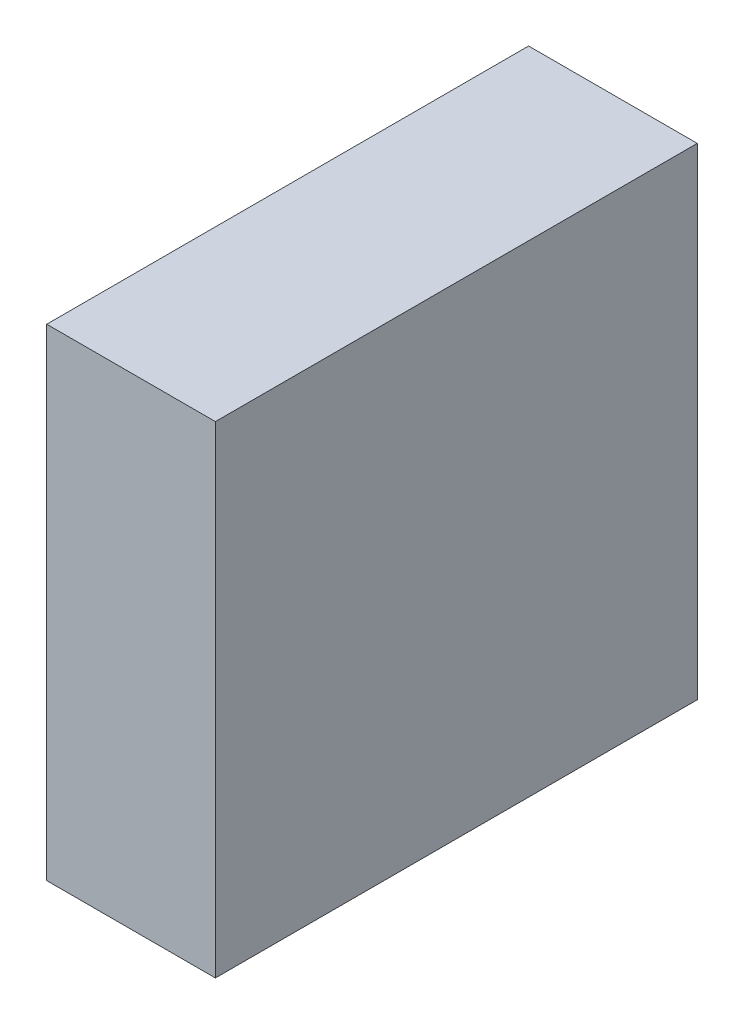
ISO-10303-21;
HEADER;
FILE_DESCRIPTION(('STEP AP214'),'2;1');
FILE_NAME('part.step','',(''),(''),'','','');
FILE_SCHEMA(('AUTOMOTIVE_DESIGN { 1 0 10303 214 1 1 1 1 }'));
ENDSEC;
DATA;
#1=APPLICATION_CONTEXT('core data for automotive mechanical design processes');
#2=APPLICATION_PROTOCOL_DEFINITION('international standard','automotive_design',2000,#1);
#3=PRODUCT_CONTEXT('',#1,'mechanical');
#4=PRODUCT('Part','Part','',(#3));
#5=PRODUCT_RELATED_PRODUCT_CATEGORY('part','',(#4));
#6=PRODUCT_DEFINITION_FORMATION('','',#4);
#7=PRODUCT_DEFINITION_CONTEXT('part definition',#1,'design');
#8=PRODUCT_DEFINITION('design','',#6,#7);
#9=PRODUCT_DEFINITION_SHAPE('','',#8);
#10=(LENGTH_UNIT() NAMED_UNIT(*) SI_UNIT(.MILLI.,.METRE.));
#11=(NAMED_UNIT(*) PLANE_ANGLE_UNIT() SI_UNIT($,.RADIAN.));
#12=(NAMED_UNIT(*) SI_UNIT($,.STERADIAN.) SOLID_ANGLE_UNIT());
#13=UNCERTAINTY_MEASURE_WITH_UNIT(LENGTH_MEASURE(1.E-05),#10,'distance_accuracy_value','');
#14=(GEOMETRIC_REPRESENTATION_CONTEXT(3) GLOBAL_UNCERTAINTY_ASSIGNED_CONTEXT((#13)) GLOBAL_UNIT_ASSIGNED_CONTEXT((#10,
#11,#12)) REPRESENTATION_CONTEXT('',''));
#15=CARTESIAN_POINT('',(0.,0.,0.));
#16=DIRECTION('',(0.,0.,1.));
#17=DIRECTION('',(1.,0.,0.));
#18=AXIS2_PLACEMENT_3D('',#15,#16,#17);
#19=CARTESIAN_POINT('',(14.,-20.,20.));
#20=DIRECTION('',(0.,1.,0.));
#21=DIRECTION('',(0.,0.,1.));
#22=AXIS2_PLACEMENT_3D('',#19,#20,#21);
#23=PLANE('',#22);
#24=DIRECTION('',(0.,0.,-1.));
#25=VECTOR('',#24,1.);
#26=CARTESIAN_POINT('',(0.,-20.,20.));
#27=LINE('',#26,#25);
#28=CARTESIAN_POINT('',(0.,-20.,20.));
#29=VERTEX_POINT('',#28);
#30=CARTESIAN_POINT('',(0.,-20.,-20.));
#31=VERTEX_POINT('',#30);
#32=EDGE_CURVE('E113',#29,#31,#27,.T.);
#33=ORIENTED_EDGE('',*,*,#32,.T.);
#34=DIRECTION('',(-1.,0.,0.));
#35=VECTOR('',#34,1.);
#36=CARTESIAN_POINT('',(14.,-20.,-20.));
#37=LINE('',#36,#35);
#38=CARTESIAN_POINT('',(14.,-20.,-20.));
#39=VERTEX_POINT('',#38);
#40=EDGE_CURVE('E11',#39,#31,#37,.T.);
#41=ORIENTED_EDGE('',*,*,#40,.F.);
#42=DIRECTION('',(0.,0.,-1.));
#43=VECTOR('',#42,1.);
#44=CARTESIAN_POINT('',(14.,-20.,20.));
#45=LINE('',#44,#43);
#46=CARTESIAN_POINT('',(14.,-20.,20.));
#47=VERTEX_POINT('',#46);
#48=EDGE_CURVE('E97',#47,#39,#45,.T.);
#49=ORIENTED_EDGE('',*,*,#48,.F.);
#50=DIRECTION('',(-1.,0.,0.));
#51=VECTOR('',#50,1.);
#52=CARTESIAN_POINT('',(14.,-20.,20.));
#53=LINE('',#52,#51);
#54=EDGE_CURVE('E109',#47,#29,#53,.T.);
#55=ORIENTED_EDGE('',*,*,#54,.T.);
#56=EDGE_LOOP('',(#33,#41,#49,#55));
#57=FACE_BOUND('',#56,.T.);
#58=ADVANCED_FACE('F45',(#57),#23,.F.);
#59=CARTESIAN_POINT('',(14.,20.,-20.));
#60=DIRECTION('',(0.,0.,1.));
#61=DIRECTION('',(0.,-1.,0.));
#62=AXIS2_PLACEMENT_3D('',#59,#60,#61);
#63=PLANE('',#62);
#64=DIRECTION('',(0.,1.,0.));
#65=VECTOR('',#64,1.);
#66=CARTESIAN_POINT('',(0.,20.,-20.));
#67=LINE('',#66,#65);
#68=CARTESIAN_POINT('',(0.,20.,-20.));
#69=VERTEX_POINT('',#68);
#70=EDGE_CURVE('E102',#31,#69,#67,.T.);
#71=ORIENTED_EDGE('',*,*,#70,.T.);
#72=DIRECTION('',(-1.,0.,0.));
#73=VECTOR('',#72,1.);
#74=CARTESIAN_POINT('',(14.,20.,-20.));
#75=LINE('',#74,#73);
#76=CARTESIAN_POINT('',(14.,20.,-20.));
#77=VERTEX_POINT('',#76);
#78=EDGE_CURVE('E54',#77,#69,#75,.T.);
#79=ORIENTED_EDGE('',*,*,#78,.F.);
#80=DIRECTION('',(0.,1.,0.));
#81=VECTOR('',#80,1.);
#82=CARTESIAN_POINT('',(14.,20.,-20.));
#83=LINE('',#82,#81);
#84=EDGE_CURVE('E92',#39,#77,#83,.T.);
#85=ORIENTED_EDGE('',*,*,#84,.F.);
#86=ORIENTED_EDGE('',*,*,#40,.T.);
#87=EDGE_LOOP('',(#71,#79,#85,#86));
#88=FACE_BOUND('',#87,.T.);
#89=ADVANCED_FACE('F101',(#88),#63,.F.);
#90=CARTESIAN_POINT('',(14.,20.,20.));
#91=DIRECTION('',(0.,-1.,0.));
#92=DIRECTION('',(0.,0.,-1.));
#93=AXIS2_PLACEMENT_3D('',#90,#91,#92);
#94=PLANE('',#93);
#95=DIRECTION('',(0.,0.,1.));
#96=VECTOR('',#95,1.);
#97=CARTESIAN_POINT('',(0.,20.,20.));
#98=LINE('',#97,#96);
#99=CARTESIAN_POINT('',(0.,20.,20.));
#100=VERTEX_POINT('',#99);
#101=EDGE_CURVE('E79',#69,#100,#98,.T.);
#102=ORIENTED_EDGE('',*,*,#101,.T.);
#103=DIRECTION('',(-1.,0.,0.));
#104=VECTOR('',#103,1.);
#105=CARTESIAN_POINT('',(14.,20.,20.));
#106=LINE('',#105,#104);
#107=CARTESIAN_POINT('',(14.,20.,20.));
#108=VERTEX_POINT('',#107);
#109=EDGE_CURVE('E104',#108,#100,#106,.T.);
#110=ORIENTED_EDGE('',*,*,#109,.F.);
#111=DIRECTION('',(0.,0.,1.));
#112=VECTOR('',#111,1.);
#113=CARTESIAN_POINT('',(14.,20.,20.));
#114=LINE('',#113,#112);
#115=EDGE_CURVE('E95',#77,#108,#114,.T.);
#116=ORIENTED_EDGE('',*,*,#115,.F.);
#117=ORIENTED_EDGE('',*,*,#78,.T.);
#118=EDGE_LOOP('',(#102,#110,#116,#117));
#119=FACE_BOUND('',#118,.T.);
#120=ADVANCED_FACE('F105',(#119),#94,.F.);
#121=CARTESIAN_POINT('',(14.,20.,20.));
#122=DIRECTION('',(0.,0.,-1.));
#123=DIRECTION('',(0.,1.,0.));
#124=AXIS2_PLACEMENT_3D('',#121,#122,#123);
#125=PLANE('',#124);
#126=DIRECTION('',(0.,-1.,0.));
#127=VECTOR('',#126,1.);
#128=CARTESIAN_POINT('',(0.,20.,20.));
#129=LINE('',#128,#127);
#130=EDGE_CURVE('E85',#100,#29,#129,.T.);
#131=ORIENTED_EDGE('',*,*,#130,.T.);
#132=ORIENTED_EDGE('',*,*,#54,.F.);
#133=DIRECTION('',(0.,-1.,0.));
#134=VECTOR('',#133,1.);
#135=CARTESIAN_POINT('',(14.,20.,20.));
#136=LINE('',#135,#134);
#137=EDGE_CURVE('E62',#108,#47,#136,.T.);
#138=ORIENTED_EDGE('',*,*,#137,.F.);
#139=ORIENTED_EDGE('',*,*,#109,.T.);
#140=EDGE_LOOP('',(#131,#132,#138,#139));
#141=FACE_BOUND('',#140,.T.);
#142=ADVANCED_FACE('F126',(#141),#125,.F.);
#143=CARTESIAN_POINT('',(14.,0.,0.));
#144=DIRECTION('',(-1.,0.,0.));
#145=DIRECTION('',(0.,0.,1.));
#146=AXIS2_PLACEMENT_3D('',#143,#144,#145);
#147=PLANE('',#146);
#148=ORIENTED_EDGE('',*,*,#48,.T.);
#149=ORIENTED_EDGE('',*,*,#84,.T.);
#150=ORIENTED_EDGE('',*,*,#115,.T.);
#151=ORIENTED_EDGE('',*,*,#137,.T.);
#152=EDGE_LOOP('',(#148,#149,#150,#151));
#153=FACE_BOUND('',#152,.T.);
#154=ADVANCED_FACE('F93',(#153),#147,.F.);
#155=CARTESIAN_POINT('',(0.,0.,0.));
#156=DIRECTION('',(-1.,0.,0.));
#157=DIRECTION('',(0.,0.,1.));
#158=AXIS2_PLACEMENT_3D('',#155,#156,#157);
#159=PLANE('',#158);
#160=ORIENTED_EDGE('',*,*,#32,.F.);
#161=ORIENTED_EDGE('',*,*,#130,.F.);
#162=ORIENTED_EDGE('',*,*,#101,.F.);
#163=ORIENTED_EDGE('',*,*,#70,.F.);
#164=EDGE_LOOP('',(#160,#161,#162,#163));
#165=FACE_BOUND('',#164,.T.);
#166=ADVANCED_FACE('F129',(#165),#159,.T.);
#167=CLOSED_SHELL('',(#58,#89,#120,#142,#154,#166));
#168=MANIFOLD_SOLID_BREP('B2',#167);
#169=ADVANCED_BREP_SHAPE_REPRESENTATION('',(#18,#168),#14);
#170=SHAPE_DEFINITION_REPRESENTATION(#9,#169);
ENDSEC;
END-ISO-10303-21;
